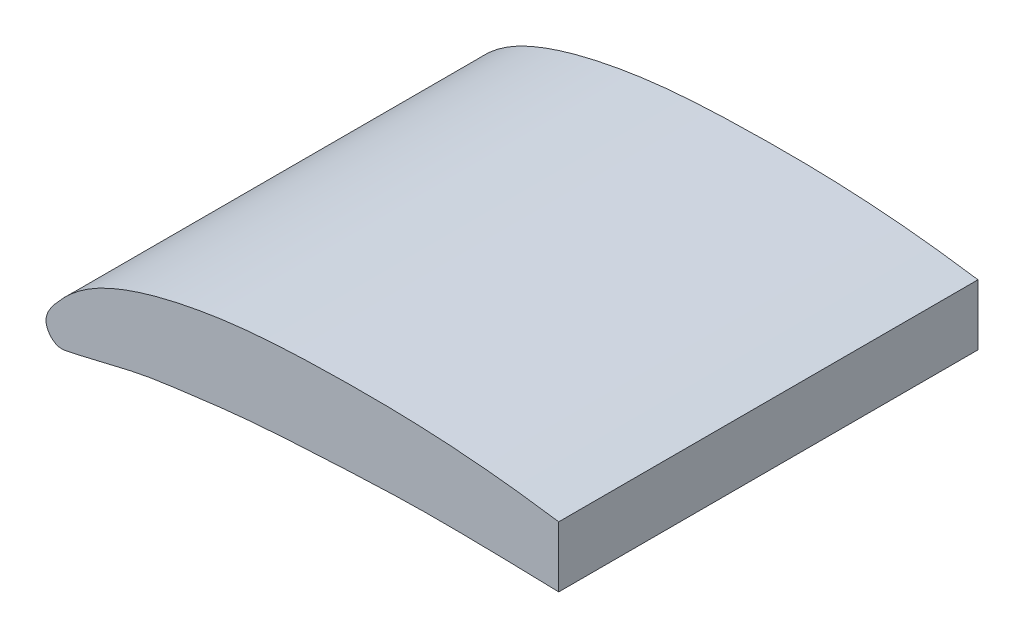
ISO-10303-21;
HEADER;
FILE_DESCRIPTION(('STEP AP214'),'2;1');
FILE_NAME('part.step','',(''),(''),'','','');
FILE_SCHEMA(('AUTOMOTIVE_DESIGN { 1 0 10303 214 1 1 1 1 }'));
ENDSEC;
DATA;
#1=APPLICATION_CONTEXT('core data for automotive mechanical design processes');
#2=APPLICATION_PROTOCOL_DEFINITION('international standard','automotive_design',2000,#1);
#3=PRODUCT_CONTEXT('',#1,'mechanical');
#4=PRODUCT('Part','Part','',(#3));
#5=PRODUCT_RELATED_PRODUCT_CATEGORY('part','',(#4));
#6=PRODUCT_DEFINITION_FORMATION('','',#4);
#7=PRODUCT_DEFINITION_CONTEXT('part definition',#1,'design');
#8=PRODUCT_DEFINITION('design','',#6,#7);
#9=PRODUCT_DEFINITION_SHAPE('','',#8);
#10=(LENGTH_UNIT() NAMED_UNIT(*) SI_UNIT(.MILLI.,.METRE.));
#11=(NAMED_UNIT(*) PLANE_ANGLE_UNIT() SI_UNIT($,.RADIAN.));
#12=(NAMED_UNIT(*) SI_UNIT($,.STERADIAN.) SOLID_ANGLE_UNIT());
#13=UNCERTAINTY_MEASURE_WITH_UNIT(LENGTH_MEASURE(1.E-05),#10,'distance_accuracy_value','');
#14=(GEOMETRIC_REPRESENTATION_CONTEXT(3) GLOBAL_UNCERTAINTY_ASSIGNED_CONTEXT((#13)) GLOBAL_UNIT_ASSIGNED_CONTEXT((#10,
#11,#12)) REPRESENTATION_CONTEXT('',''));
#15=CARTESIAN_POINT('',(0.,0.,0.));
#16=DIRECTION('',(0.,0.,1.));
#17=DIRECTION('',(1.,0.,0.));
#18=AXIS2_PLACEMENT_3D('',#15,#16,#17);
#19=CARTESIAN_POINT('',(139.7,-4.68396711475495E-13,114.3));
#20=DIRECTION('',(-1.,0.,0.));
#21=DIRECTION('',(0.,-1.,0.));
#22=AXIS2_PLACEMENT_3D('',#19,#20,#21);
#23=PLANE('',#22);
#24=DIRECTION('',(0.,1.,0.));
#25=VECTOR('',#24,1.);
#26=CARTESIAN_POINT('',(139.7,-4.68396711475495E-13,0.));
#27=LINE('',#26,#25);
#28=CARTESIAN_POINT('',(139.7,6.6098892329599,0.));
#29=VERTEX_POINT('',#28);
#30=CARTESIAN_POINT('',(139.7,23.1661707716966,0.));
#31=VERTEX_POINT('',#30);
#32=EDGE_CURVE('E76',#29,#31,#27,.T.);
#33=ORIENTED_EDGE('',*,*,#32,.T.);
#34=DIRECTION('',(0.,0.,-1.));
#35=VECTOR('',#34,1.);
#36=CARTESIAN_POINT('',(139.7,23.1661707716966,114.3));
#37=LINE('',#36,#35);
#38=CARTESIAN_POINT('',(139.7,23.1661707716966,114.3));
#39=VERTEX_POINT('',#38);
#40=EDGE_CURVE('E11',#39,#31,#37,.T.);
#41=ORIENTED_EDGE('',*,*,#40,.F.);
#42=DIRECTION('',(0.,1.,0.));
#43=VECTOR('',#42,1.);
#44=CARTESIAN_POINT('',(139.7,-4.68396711475495E-13,114.3));
#45=LINE('',#44,#43);
#46=CARTESIAN_POINT('',(139.7,6.6098892329599,114.3));
#47=VERTEX_POINT('',#46);
#48=EDGE_CURVE('E75',#47,#39,#45,.T.);
#49=ORIENTED_EDGE('',*,*,#48,.F.);
#50=DIRECTION('',(0.,0.,-1.));
#51=VECTOR('',#50,1.);
#52=CARTESIAN_POINT('',(139.7,6.6098892329599,114.3));
#53=LINE('',#52,#51);
#54=EDGE_CURVE('E53',#47,#29,#53,.T.);
#55=ORIENTED_EDGE('',*,*,#54,.T.);
#56=EDGE_LOOP('',(#33,#41,#49,#55));
#57=FACE_BOUND('',#56,.T.);
#58=ADVANCED_FACE('F45',(#57),#23,.F.);
#59=CARTESIAN_POINT('',(254.,0.889,114.3));
#60=CARTESIAN_POINT('',(249.755300970815,1.87859335879138,114.3));
#61=CARTESIAN_POINT('',(241.284220880923,3.85350949327115,114.3));
#62=CARTESIAN_POINT('',(224.315824878738,7.47360796274141,114.3));
#63=CARTESIAN_POINT('',(203.05645214663,11.527247875921,114.3));
#64=CARTESIAN_POINT('',(177.661285298347,16.7283151711408,114.3));
#65=CARTESIAN_POINT('',(152.225299570029,21.2845866773474,114.3));
#66=CARTESIAN_POINT('',(126.828421648593,25.2079785656243,114.3));
#67=CARTESIAN_POINT('',(101.333206340152,27.1528883192298,114.3));
#68=CARTESIAN_POINT('',(75.8855775698564,27.1773494799594,114.3));
#69=CARTESIAN_POINT('',(54.6410711732149,26.1944719622386,114.3));
#70=CARTESIAN_POINT('',(37.7241163214368,23.4783326302527,114.3));
#71=CARTESIAN_POINT('',(27.1417884701442,20.8628241390568,114.3));
#72=CARTESIAN_POINT('',(18.7017015238388,17.8363751494572,114.3));
#73=CARTESIAN_POINT('',(12.2245669579805,14.7192309641996,114.3));
#74=CARTESIAN_POINT('',(6.86434226787735,10.8535428339271,114.3));
#75=CARTESIAN_POINT('',(2.51235855602438,6.22581458658149,114.3));
#76=CARTESIAN_POINT('',(-1.73290163626524,0.897528071081177,114.3));
#77=CARTESIAN_POINT('',(2.55713928637989,-4.25701737593825,114.3));
#78=CARTESIAN_POINT('',(7.56240835156454,-3.187950948253,114.3));
#79=CARTESIAN_POINT('',(12.6981755886411,-1.97881196697224,114.3));
#80=CARTESIAN_POINT('',(19.0497788713052,-0.425917760205466,114.3));
#81=CARTESIAN_POINT('',(27.4331723433081,1.48652075883262,114.3));
#82=CARTESIAN_POINT('',(38.055130020046,2.87246029503792,114.3));
#83=CARTESIAN_POINT('',(54.9248511737947,5.06353567073955,114.3));
#84=CARTESIAN_POINT('',(76.1187279823022,6.22695218699561,114.3));
#85=CARTESIAN_POINT('',(101.511907223727,7.47215019118125,114.3));
#86=CARTESIAN_POINT('',(126.928831839546,6.95185663813201,114.3));
#87=CARTESIAN_POINT('',(152.35396728999,6.3243740525819,114.3));
#88=CARTESIAN_POINT('',(177.75502548679,4.53400447741137,114.3));
#89=CARTESIAN_POINT('',(203.173260156956,2.78508361262511,114.3));
#90=CARTESIAN_POINT('',(224.335303209527,1.01678746856236,114.3));
#91=CARTESIAN_POINT('',(241.313406146471,0.326551109011815,114.3));
#92=CARTESIAN_POINT('',(249.76853137359,-0.483566796969676,114.3));
#93=CARTESIAN_POINT('',(254.,-0.889,114.3));
#94=B_SPLINE_CURVE_WITH_KNOTS('',3,(#59,#60,#61,#62,#63,#64,#65,#66,#67,#68,#69,#70,#71,#72,#73,
#74,#75,#76,#77,#78,#79,#80,#81,#82,#83,#84,#85,#86,#87,#88,#89,#90,#91,#92,#93),.UNSPECIFIED.,
.F.,.F.,(4,1,1,1,1,1,1,1,1,1,1,1,1,1,1,1,1,1,1,1,1,1,1,1,1,1,1,1,1,1,1,1,4),(0.,
0.0250449926618631,0.0499819038359856,0.0996928768778378,0.149404795317062,0.198930977090374,
0.248177786536747,0.297011091751789,0.345668691545482,0.394384356967894,0.418981924979963,
0.444018058552479,0.456912725617499,0.470404889353766,0.485361367241275,0.494028905478234,
0.508284261990904,0.517561661069311,0.523649237949193,0.536104636845839,0.548578769024395,
0.561002028831032,0.585561942244513,0.610032722389853,0.658766283263026,0.707434665540439,
0.756093744160532,0.804784589183796,0.853570641090438,0.902385984381083,0.951201327671728,
0.975578120321006,1.),.UNSPECIFIED.);
#95=DIRECTION('',(0.,0.,-1.));
#96=VECTOR('',#95,1.);
#97=SURFACE_OF_LINEAR_EXTRUSION('',#94,#96);
#98=CARTESIAN_POINT('',(254.,0.889,0.));
#99=CARTESIAN_POINT('',(249.755300970815,1.87859335879138,0.));
#100=CARTESIAN_POINT('',(241.284220880923,3.85350949327115,0.));
#101=CARTESIAN_POINT('',(224.315824878738,7.47360796274141,0.));
#102=CARTESIAN_POINT('',(203.05645214663,11.527247875921,0.));
#103=CARTESIAN_POINT('',(177.661285298347,16.7283151711408,0.));
#104=CARTESIAN_POINT('',(152.225299570029,21.2845866773474,0.));
#105=CARTESIAN_POINT('',(126.828421648593,25.2079785656243,0.));
#106=CARTESIAN_POINT('',(101.333206340152,27.1528883192298,0.));
#107=CARTESIAN_POINT('',(75.8855775698564,27.1773494799594,0.));
#108=CARTESIAN_POINT('',(54.6410711732149,26.1944719622386,0.));
#109=CARTESIAN_POINT('',(37.7241163214368,23.4783326302527,0.));
#110=CARTESIAN_POINT('',(27.1417884701442,20.8628241390568,0.));
#111=CARTESIAN_POINT('',(18.7017015238388,17.8363751494572,0.));
#112=CARTESIAN_POINT('',(12.2245669579805,14.7192309641996,0.));
#113=CARTESIAN_POINT('',(6.86434226787735,10.8535428339271,0.));
#114=CARTESIAN_POINT('',(2.51235855602438,6.22581458658149,0.));
#115=CARTESIAN_POINT('',(-1.73290163626524,0.897528071081177,0.));
#116=CARTESIAN_POINT('',(2.55713928637989,-4.25701737593825,0.));
#117=CARTESIAN_POINT('',(7.56240835156454,-3.187950948253,0.));
#118=CARTESIAN_POINT('',(12.6981755886411,-1.97881196697224,0.));
#119=CARTESIAN_POINT('',(19.0497788713052,-0.425917760205466,0.));
#120=CARTESIAN_POINT('',(27.4331723433081,1.48652075883262,0.));
#121=CARTESIAN_POINT('',(38.055130020046,2.87246029503792,0.));
#122=CARTESIAN_POINT('',(54.9248511737947,5.06353567073955,0.));
#123=CARTESIAN_POINT('',(76.1187279823022,6.22695218699561,0.));
#124=CARTESIAN_POINT('',(101.511907223727,7.47215019118125,0.));
#125=CARTESIAN_POINT('',(126.928831839546,6.95185663813201,0.));
#126=CARTESIAN_POINT('',(152.35396728999,6.3243740525819,0.));
#127=CARTESIAN_POINT('',(177.75502548679,4.53400447741137,0.));
#128=CARTESIAN_POINT('',(203.173260156956,2.78508361262511,0.));
#129=CARTESIAN_POINT('',(224.335303209527,1.01678746856236,0.));
#130=CARTESIAN_POINT('',(241.313406146471,0.326551109011815,0.));
#131=CARTESIAN_POINT('',(249.76853137359,-0.483566796969676,0.));
#132=CARTESIAN_POINT('',(254.,-0.889,0.));
#133=B_SPLINE_CURVE_WITH_KNOTS('',3,(#98,#99,#100,#101,#102,#103,#104,#105,#106,#107,#108,#109,
#110,#111,#112,#113,#114,#115,#116,#117,#118,#119,#120,#121,#122,#123,#124,#125,#126,#127,#128,
#129,#130,#131,#132),.UNSPECIFIED.,.F.,.F.,(4,1,1,1,1,1,1,1,1,1,1,1,1,1,1,1,1,1,1,1,1,1,1,1,1,1,
1,1,1,1,1,1,4),(0.,0.0250449926618631,0.0499819038359856,0.0996928768778378,0.149404795317062,
0.198930977090374,0.248177786536747,0.297011091751789,0.345668691545482,0.394384356967894,
0.418981924979963,0.444018058552479,0.456912725617499,0.470404889353766,0.485361367241275,
0.494028905478234,0.508284261990904,0.517561661069311,0.523649237949193,0.536104636845839,
0.548578769024395,0.561002028831032,0.585561942244513,0.610032722389853,0.658766283263026,
0.707434665540439,0.756093744160532,0.804784589183796,0.853570641090438,0.902385984381083,
0.951201327671728,0.975578120321006,1.),.UNSPECIFIED.);
#134=EDGE_CURVE('E68',#31,#29,#133,.T.);
#135=ORIENTED_EDGE('',*,*,#134,.T.);
#136=ORIENTED_EDGE('',*,*,#54,.F.);
#137=EDGE_CURVE('E60',#39,#47,#94,.T.);
#138=ORIENTED_EDGE('',*,*,#137,.F.);
#139=ORIENTED_EDGE('',*,*,#40,.T.);
#140=EDGE_LOOP('',(#135,#136,#138,#139));
#141=FACE_BOUND('',#140,.T.);
#142=ADVANCED_FACE('F71',(#141),#97,.F.);
#143=CARTESIAN_POINT('',(0.,0.,114.3));
#144=DIRECTION('',(0.,0.,1.));
#145=DIRECTION('',(1.,0.,0.));
#146=AXIS2_PLACEMENT_3D('',#143,#144,#145);
#147=PLANE('',#146);
#148=ORIENTED_EDGE('',*,*,#48,.T.);
#149=ORIENTED_EDGE('',*,*,#137,.T.);
#150=EDGE_LOOP('',(#148,#149));
#151=FACE_BOUND('',#150,.T.);
#152=ADVANCED_FACE('F96',(#151),#147,.T.);
#153=CARTESIAN_POINT('',(0.,0.,0.));
#154=DIRECTION('',(0.,0.,1.));
#155=DIRECTION('',(1.,0.,0.));
#156=AXIS2_PLACEMENT_3D('',#153,#154,#155);
#157=PLANE('',#156);
#158=ORIENTED_EDGE('',*,*,#32,.F.);
#159=ORIENTED_EDGE('',*,*,#134,.F.);
#160=EDGE_LOOP('',(#158,#159));
#161=FACE_BOUND('',#160,.T.);
#162=ADVANCED_FACE('F79',(#161),#157,.F.);
#163=CLOSED_SHELL('',(#58,#142,#152,#162));
#164=MANIFOLD_SOLID_BREP('B2',#163);
#165=ADVANCED_BREP_SHAPE_REPRESENTATION('',(#18,#164),#14);
#166=SHAPE_DEFINITION_REPRESENTATION(#9,#165);
ENDSEC;
END-ISO-10303-21;
